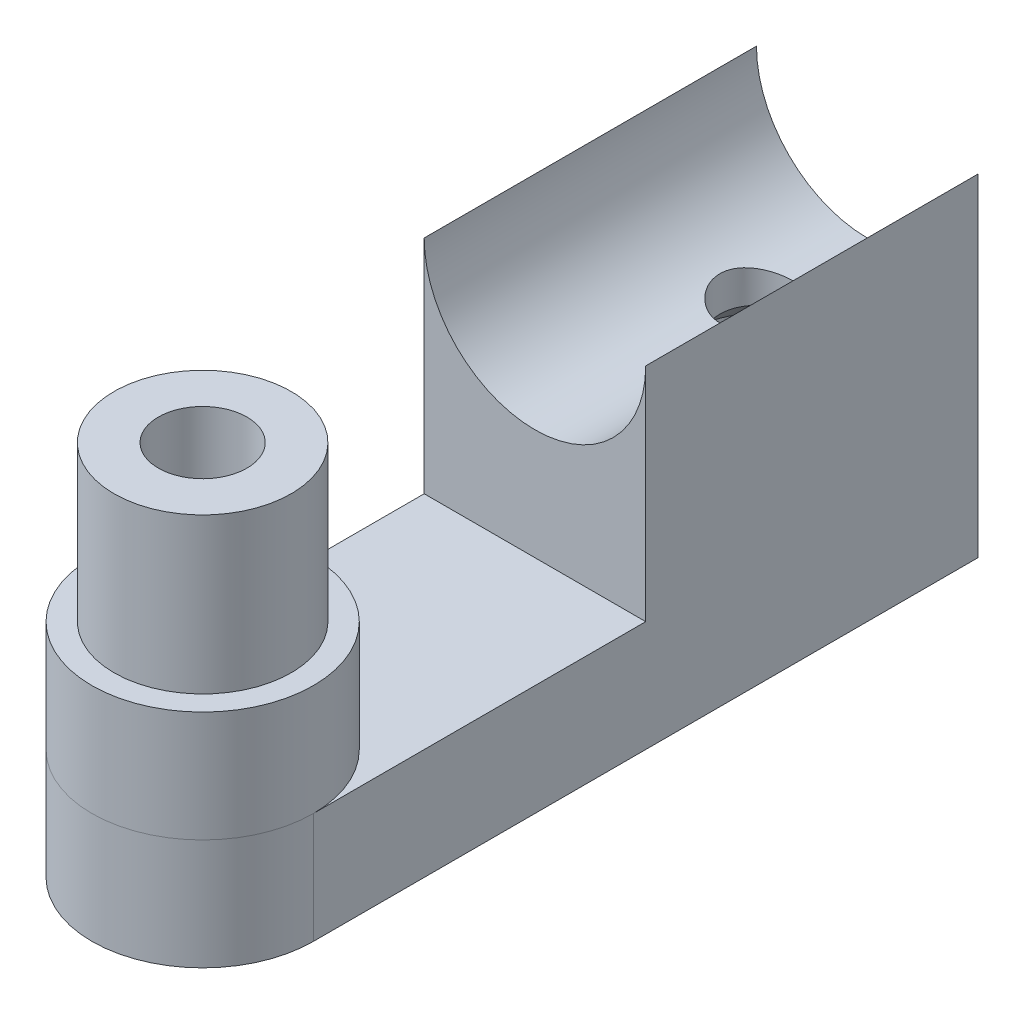
ISO-10303-21;
HEADER;
FILE_DESCRIPTION(('STEP AP214'),'2;1');
FILE_NAME('part.step','',(''),(''),'','','');
FILE_SCHEMA(('AUTOMOTIVE_DESIGN { 1 0 10303 214 1 1 1 1 }'));
ENDSEC;
DATA;
#1=APPLICATION_CONTEXT('core data for automotive mechanical design processes');
#2=APPLICATION_PROTOCOL_DEFINITION('international standard','automotive_design',2000,#1);
#3=PRODUCT_CONTEXT('',#1,'mechanical');
#4=PRODUCT('Part','Part','',(#3));
#5=PRODUCT_RELATED_PRODUCT_CATEGORY('part','',(#4));
#6=PRODUCT_DEFINITION_FORMATION('','',#4);
#7=PRODUCT_DEFINITION_CONTEXT('part definition',#1,'design');
#8=PRODUCT_DEFINITION('design','',#6,#7);
#9=PRODUCT_DEFINITION_SHAPE('','',#8);
#10=(LENGTH_UNIT() NAMED_UNIT(*) SI_UNIT(.MILLI.,.METRE.));
#11=(NAMED_UNIT(*) PLANE_ANGLE_UNIT() SI_UNIT($,.RADIAN.));
#12=(NAMED_UNIT(*) SI_UNIT($,.STERADIAN.) SOLID_ANGLE_UNIT());
#13=UNCERTAINTY_MEASURE_WITH_UNIT(LENGTH_MEASURE(1.E-05),#10,'distance_accuracy_value','');
#14=(GEOMETRIC_REPRESENTATION_CONTEXT(3) GLOBAL_UNCERTAINTY_ASSIGNED_CONTEXT((#13)) GLOBAL_UNIT_ASSIGNED_CONTEXT((#10,
#11,#12)) REPRESENTATION_CONTEXT('',''));
#15=CARTESIAN_POINT('',(0.,0.,0.));
#16=DIRECTION('',(0.,0.,1.));
#17=DIRECTION('',(1.,0.,0.));
#18=AXIS2_PLACEMENT_3D('',#15,#16,#17);
#19=CARTESIAN_POINT('',(0.,-5.,0.));
#20=DIRECTION('',(0.,-1.,0.));
#21=DIRECTION('',(0.,0.,-1.));
#22=AXIS2_PLACEMENT_3D('',#19,#20,#21);
#23=PLANE('',#22);
#24=DIRECTION('',(1.,0.,0.));
#25=VECTOR('',#24,1.);
#26=CARTESIAN_POINT('',(5.,-5.,-15.));
#27=LINE('',#26,#25);
#28=CARTESIAN_POINT('',(-5.,-5.,-15.));
#29=VERTEX_POINT('',#28);
#30=CARTESIAN_POINT('',(5.,-5.,-15.));
#31=VERTEX_POINT('',#30);
#32=EDGE_CURVE('E76',#29,#31,#27,.T.);
#33=ORIENTED_EDGE('',*,*,#32,.F.);
#34=DIRECTION('',(0.,0.,-1.));
#35=VECTOR('',#34,1.);
#36=CARTESIAN_POINT('',(-5.,-5.,0.));
#37=LINE('',#36,#35);
#38=CARTESIAN_POINT('',(-5.,-5.,0.));
#39=VERTEX_POINT('',#38);
#40=EDGE_CURVE('E175',#39,#29,#37,.T.);
#41=ORIENTED_EDGE('',*,*,#40,.F.);
#42=CARTESIAN_POINT('',(0.,-5.,0.));
#43=DIRECTION('',(0.,-1.,0.));
#44=DIRECTION('',(0.,0.,-1.));
#45=AXIS2_PLACEMENT_3D('',#42,#43,#44);
#46=CIRCLE('',#45,5.);
#47=CARTESIAN_POINT('',(5.,-5.,0.));
#48=VERTEX_POINT('',#47);
#49=EDGE_CURVE('E161',#48,#39,#46,.T.);
#50=ORIENTED_EDGE('',*,*,#49,.F.);
#51=DIRECTION('',(0.,0.,1.));
#52=VECTOR('',#51,1.);
#53=CARTESIAN_POINT('',(5.,-5.,-30.));
#54=LINE('',#53,#52);
#55=EDGE_CURVE('E98',#31,#48,#54,.T.);
#56=ORIENTED_EDGE('',*,*,#55,.F.);
#57=EDGE_LOOP('',(#33,#41,#50,#56));
#58=FACE_BOUND('',#57,.T.);
#59=ADVANCED_FACE('F59',(#58),#23,.F.);
#60=CARTESIAN_POINT('',(0.,-10.,0.));
#61=DIRECTION('',(0.,1.,0.));
#62=DIRECTION('',(0.,0.,1.));
#63=AXIS2_PLACEMENT_3D('',#60,#61,#62);
#64=CYLINDRICAL_SURFACE('',#63,5.);
#65=ORIENTED_EDGE('',*,*,#49,.T.);
#66=DIRECTION('',(0.,1.,0.));
#67=VECTOR('',#66,1.);
#68=CARTESIAN_POINT('',(-5.,-10.,0.));
#69=LINE('',#68,#67);
#70=CARTESIAN_POINT('',(-5.,-10.,0.));
#71=VERTEX_POINT('',#70);
#72=EDGE_CURVE('E142',#71,#39,#69,.T.);
#73=ORIENTED_EDGE('',*,*,#72,.F.);
#74=CARTESIAN_POINT('',(0.,-10.,0.));
#75=DIRECTION('',(0.,-1.,0.));
#76=DIRECTION('',(0.,0.,-1.));
#77=AXIS2_PLACEMENT_3D('',#74,#75,#76);
#78=CIRCLE('',#77,5.);
#79=CARTESIAN_POINT('',(5.,-10.,0.));
#80=VERTEX_POINT('',#79);
#81=EDGE_CURVE('E162',#80,#71,#78,.T.);
#82=ORIENTED_EDGE('',*,*,#81,.F.);
#83=DIRECTION('',(0.,1.,0.));
#84=VECTOR('',#83,1.);
#85=CARTESIAN_POINT('',(5.,-10.,0.));
#86=LINE('',#85,#84);
#87=EDGE_CURVE('E171',#80,#48,#86,.T.);
#88=ORIENTED_EDGE('',*,*,#87,.T.);
#89=EDGE_LOOP('',(#65,#73,#82,#88));
#90=FACE_BOUND('',#89,.T.);
#91=ADVANCED_FACE('F211',(#90),#64,.T.);
#92=CARTESIAN_POINT('',(-5.,-10.,0.));
#93=DIRECTION('',(1.,0.,0.));
#94=DIRECTION('',(0.,0.,-1.));
#95=AXIS2_PLACEMENT_3D('',#92,#93,#94);
#96=PLANE('',#95);
#97=ORIENTED_EDGE('',*,*,#40,.T.);
#98=DIRECTION('',(0.,-1.,0.));
#99=VECTOR('',#98,1.);
#100=CARTESIAN_POINT('',(-5.,5.,-15.));
#101=LINE('',#100,#99);
#102=CARTESIAN_POINT('',(-5.,5.,-15.));
#103=VERTEX_POINT('',#102);
#104=EDGE_CURVE('E148',#103,#29,#101,.T.);
#105=ORIENTED_EDGE('',*,*,#104,.F.);
#106=DIRECTION('',(0.,0.,1.));
#107=VECTOR('',#106,1.);
#108=CARTESIAN_POINT('',(-5.,5.,-30.));
#109=LINE('',#108,#107);
#110=CARTESIAN_POINT('',(-5.,5.,-30.));
#111=VERTEX_POINT('',#110);
#112=EDGE_CURVE('E126',#111,#103,#109,.T.);
#113=ORIENTED_EDGE('',*,*,#112,.F.);
#114=DIRECTION('',(0.,1.,0.));
#115=VECTOR('',#114,1.);
#116=CARTESIAN_POINT('',(-5.,-10.,-30.));
#117=LINE('',#116,#115);
#118=CARTESIAN_POINT('',(-5.,-10.,-30.));
#119=VERTEX_POINT('',#118);
#120=EDGE_CURVE('E138',#119,#111,#117,.T.);
#121=ORIENTED_EDGE('',*,*,#120,.F.);
#122=DIRECTION('',(0.,0.,-1.));
#123=VECTOR('',#122,1.);
#124=CARTESIAN_POINT('',(-5.,-10.,0.));
#125=LINE('',#124,#123);
#126=EDGE_CURVE('E106',#71,#119,#125,.T.);
#127=ORIENTED_EDGE('',*,*,#126,.F.);
#128=ORIENTED_EDGE('',*,*,#72,.T.);
#129=EDGE_LOOP('',(#97,#105,#113,#121,#127,#128));
#130=FACE_BOUND('',#129,.T.);
#131=ADVANCED_FACE('F146',(#130),#96,.F.);
#132=CARTESIAN_POINT('',(-5.,-10.,-30.));
#133=DIRECTION('',(0.,0.,1.));
#134=DIRECTION('',(1.,0.,0.));
#135=AXIS2_PLACEMENT_3D('',#132,#133,#134);
#136=PLANE('',#135);
#137=ORIENTED_EDGE('',*,*,#120,.T.);
#138=CARTESIAN_POINT('',(0.,5.,-30.));
#139=DIRECTION('',(0.,0.,-1.));
#140=DIRECTION('',(-1.,0.,0.));
#141=AXIS2_PLACEMENT_3D('',#138,#139,#140);
#142=CIRCLE('',#141,5.);
#143=CARTESIAN_POINT('',(5.,5.,-30.));
#144=VERTEX_POINT('',#143);
#145=EDGE_CURVE('E122',#144,#111,#142,.T.);
#146=ORIENTED_EDGE('',*,*,#145,.F.);
#147=DIRECTION('',(0.,1.,0.));
#148=VECTOR('',#147,1.);
#149=CARTESIAN_POINT('',(5.,-10.,-30.));
#150=LINE('',#149,#148);
#151=CARTESIAN_POINT('',(5.,-10.,-30.));
#152=VERTEX_POINT('',#151);
#153=EDGE_CURVE('E143',#152,#144,#150,.T.);
#154=ORIENTED_EDGE('',*,*,#153,.F.);
#155=DIRECTION('',(1.,0.,0.));
#156=VECTOR('',#155,1.);
#157=CARTESIAN_POINT('',(-5.,-10.,-30.));
#158=LINE('',#157,#156);
#159=EDGE_CURVE('E140',#119,#152,#158,.T.);
#160=ORIENTED_EDGE('',*,*,#159,.F.);
#161=EDGE_LOOP('',(#137,#146,#154,#160));
#162=FACE_BOUND('',#161,.T.);
#163=ADVANCED_FACE('F139',(#162),#136,.F.);
#164=CARTESIAN_POINT('',(5.,-10.,-30.));
#165=DIRECTION('',(-1.,0.,0.));
#166=DIRECTION('',(0.,0.,1.));
#167=AXIS2_PLACEMENT_3D('',#164,#165,#166);
#168=PLANE('',#167);
#169=ORIENTED_EDGE('',*,*,#153,.T.);
#170=DIRECTION('',(0.,0.,-1.));
#171=VECTOR('',#170,1.);
#172=CARTESIAN_POINT('',(5.,5.,-30.));
#173=LINE('',#172,#171);
#174=CARTESIAN_POINT('',(5.,5.,-15.));
#175=VERTEX_POINT('',#174);
#176=EDGE_CURVE('E129',#175,#144,#173,.T.);
#177=ORIENTED_EDGE('',*,*,#176,.F.);
#178=DIRECTION('',(0.,-1.,0.));
#179=VECTOR('',#178,1.);
#180=CARTESIAN_POINT('',(5.,5.,-15.));
#181=LINE('',#180,#179);
#182=EDGE_CURVE('E150',#175,#31,#181,.T.);
#183=ORIENTED_EDGE('',*,*,#182,.T.);
#184=ORIENTED_EDGE('',*,*,#55,.T.);
#185=ORIENTED_EDGE('',*,*,#87,.F.);
#186=DIRECTION('',(0.,0.,1.));
#187=VECTOR('',#186,1.);
#188=CARTESIAN_POINT('',(5.,-10.,-30.));
#189=LINE('',#188,#187);
#190=EDGE_CURVE('E85',#152,#80,#189,.T.);
#191=ORIENTED_EDGE('',*,*,#190,.F.);
#192=EDGE_LOOP('',(#169,#177,#183,#184,#185,#191));
#193=FACE_BOUND('',#192,.T.);
#194=ADVANCED_FACE('F220',(#193),#168,.F.);
#195=CARTESIAN_POINT('',(0.,-10.,0.));
#196=DIRECTION('',(0.,-1.,0.));
#197=DIRECTION('',(0.,0.,-1.));
#198=AXIS2_PLACEMENT_3D('',#195,#196,#197);
#199=PLANE('',#198);
#200=CARTESIAN_POINT('',(0.,-10.,-25.));
#201=DIRECTION('',(0.,-1.,0.));
#202=DIRECTION('',(0.,0.,-1.));
#203=AXIS2_PLACEMENT_3D('',#200,#201,#202);
#204=CIRCLE('',#203,2.75);
#205=CARTESIAN_POINT('',(0.,-10.,-27.75));
#206=VERTEX_POINT('',#205);
#207=EDGE_CURVE('E135',#206,#206,#204,.T.);
#208=ORIENTED_EDGE('',*,*,#207,.F.);
#209=EDGE_LOOP('',(#208));
#210=FACE_BOUND('',#209,.T.);
#211=ORIENTED_EDGE('',*,*,#81,.T.);
#212=ORIENTED_EDGE('',*,*,#126,.T.);
#213=ORIENTED_EDGE('',*,*,#159,.T.);
#214=ORIENTED_EDGE('',*,*,#190,.T.);
#215=EDGE_LOOP('',(#211,#212,#213,#214));
#216=FACE_BOUND('',#215,.T.);
#217=ADVANCED_FACE('F219',(#210,#216),#199,.T.);
#218=CARTESIAN_POINT('',(5.,5.,-15.));
#219=DIRECTION('',(0.,0.,-1.));
#220=DIRECTION('',(-1.,0.,0.));
#221=AXIS2_PLACEMENT_3D('',#218,#219,#220);
#222=PLANE('',#221);
#223=ORIENTED_EDGE('',*,*,#182,.F.);
#224=CARTESIAN_POINT('',(0.,5.,-15.));
#225=DIRECTION('',(0.,0.,-1.));
#226=DIRECTION('',(-1.,0.,0.));
#227=AXIS2_PLACEMENT_3D('',#224,#225,#226);
#228=CIRCLE('',#227,5.);
#229=EDGE_CURVE('E134',#103,#175,#228,.F.);
#230=ORIENTED_EDGE('',*,*,#229,.F.);
#231=ORIENTED_EDGE('',*,*,#104,.T.);
#232=ORIENTED_EDGE('',*,*,#32,.T.);
#233=EDGE_LOOP('',(#223,#230,#231,#232));
#234=FACE_BOUND('',#233,.T.);
#235=ADVANCED_FACE('F207',(#234),#222,.F.);
#236=CARTESIAN_POINT('',(0.,5.,-3.81966011250105));
#237=DIRECTION('',(0.,0.,-1.));
#238=DIRECTION('',(-1.,0.,0.));
#239=AXIS2_PLACEMENT_3D('',#236,#237,#238);
#240=CYLINDRICAL_SURFACE('',#239,5.);
#241=CARTESIAN_POINT('',(0.,0.,-26.65));
#242=CARTESIAN_POINT('',(0.0900803323989871,-1.25648819785886E-07,-26.6500002425144));
#243=CARTESIAN_POINT('',(0.180159574077354,0.00245687382126915,-26.642599162515));
#244=CARTESIAN_POINT('',(0.357667875169258,0.0120165182884763,-26.6132788504724));
#245=CARTESIAN_POINT('',(0.445096605656321,0.0191197374286571,-26.5913578241647));
#246=CARTESIAN_POINT('',(0.614719075952393,0.0371993185679961,-26.5338286876117));
#247=CARTESIAN_POINT('',(0.696921201899965,0.0481692812331644,-26.498243182986));
#248=CARTESIAN_POINT('',(0.854190645874482,0.0728605275116146,-26.4144964273082));
#249=CARTESIAN_POINT('',(0.929256597076053,0.0865823366403418,-26.3663327736966));
#250=CARTESIAN_POINT('',(1.07267700256014,0.115853320239857,-26.2570751769286));
#251=CARTESIAN_POINT('',(1.140755021368,0.131445631134127,-26.1956299817258));
#252=CARTESIAN_POINT('',(1.26585047260417,0.16246092195993,-26.0623004860802));
#253=CARTESIAN_POINT('',(1.32286553369749,0.177883864920705,-25.9904139533073));
#254=CARTESIAN_POINT('',(1.42578155512387,0.207286868266667,-25.8357693876205));
#255=CARTESIAN_POINT('',(1.47132547146369,0.221214251011649,-25.7527627624148));
#256=CARTESIAN_POINT('',(1.54768950007051,0.245394505162284,-25.5797343691659));
#257=CARTESIAN_POINT('',(1.57851400356116,0.255648472225038,-25.4897147026477));
#258=CARTESIAN_POINT('',(1.62353134991424,0.270867173648994,-25.3083551709187));
#259=CARTESIAN_POINT('',(1.6382413417332,0.275995877642336,-25.2171578366744));
#260=CARTESIAN_POINT('',(1.65222861163856,0.280868653520504,-25.033456387306));
#261=CARTESIAN_POINT('',(1.65151054662635,0.280614350246335,-24.9409526749323));
#262=CARTESIAN_POINT('',(1.63506410098719,0.274893708924319,-24.7616527976077));
#263=CARTESIAN_POINT('',(1.62000769651632,0.269660711203189,-24.6747862647612));
#264=CARTESIAN_POINT('',(1.57640708934977,0.254953674765128,-24.5048890938333));
#265=CARTESIAN_POINT('',(1.54786130181506,0.245479137725619,-24.4218589077347));
#266=CARTESIAN_POINT('',(1.47764674240873,0.223188260590001,-24.2604525600054));
#267=CARTESIAN_POINT('',(1.43577693123636,0.210321280523172,-24.1821711497747));
#268=CARTESIAN_POINT('',(1.34024242388315,0.182716840839682,-24.0335316376985));
#269=CARTESIAN_POINT('',(1.28657437554159,0.1679788501281,-23.9631757963059));
#270=CARTESIAN_POINT('',(1.16572801734404,0.137372017574341,-23.8286047725898));
#271=CARTESIAN_POINT('',(1.09799945388895,0.121483874059835,-23.7648871213569));
#272=CARTESIAN_POINT('',(0.952622363558089,0.0910266541347035,-23.6495858217608));
#273=CARTESIAN_POINT('',(0.874972923819721,0.0764576993193701,-23.598003291245));
#274=CARTESIAN_POINT('',(0.710918878360195,0.0500957074006091,-23.508046483163));
#275=CARTESIAN_POINT('',(0.624437715003007,0.038330520638852,-23.4698031027869));
#276=CARTESIAN_POINT('',(0.445788820584336,0.0191036548526561,-23.4085602803937));
#277=CARTESIAN_POINT('',(0.353623035566634,0.0116405120416556,-23.3855556529359));
#278=CARTESIAN_POINT('',(0.170434936942809,0.00209998070460758,-23.3563192146167));
#279=CARTESIAN_POINT('',(0.0795310449403306,-0.00019320840938875,-23.3494149063605));
#280=CARTESIAN_POINT('',(-0.102152997074191,0.000218796006793008,-23.3506626326913));
#281=CARTESIAN_POINT('',(-0.19293316503069,0.00292316476573073,-23.3588121828668));
#282=CARTESIAN_POINT('',(-0.369117276094976,0.0128840710918336,-23.3894028261829));
#283=CARTESIAN_POINT('',(-0.454600657078433,0.0200097019350463,-23.4114332100145));
#284=CARTESIAN_POINT('',(-0.620625393385987,0.0379638978335999,-23.4686486915117));
#285=CARTESIAN_POINT('',(-0.701166119538832,0.0487929331624024,-23.5038354598819));
#286=CARTESIAN_POINT('',(-0.857353583850656,0.0734026180974383,-23.5873810195524));
#287=CARTESIAN_POINT('',(-0.932818538636808,0.0872527140051663,-23.6360586147645));
#288=CARTESIAN_POINT('',(-1.07472879779133,0.116331936609704,-23.7448282347959));
#289=CARTESIAN_POINT('',(-1.14117138619964,0.131561476264165,-23.804923683674));
#290=CARTESIAN_POINT('',(-1.26622547851877,0.162540901525089,-23.9379861726919));
#291=CARTESIAN_POINT('',(-1.32435715949936,0.17828379839998,-24.0114068669237));
#292=CARTESIAN_POINT('',(-1.42753142742357,0.207814329533679,-24.1672998548937));
#293=CARTESIAN_POINT('',(-1.47257396443646,0.22160195633368,-24.2497721831592));
#294=CARTESIAN_POINT('',(-1.54806908435208,0.245522531296669,-24.4214254839583));
#295=CARTESIAN_POINT('',(-1.57855621066785,0.255664118086352,-24.5105899859772));
#296=CARTESIAN_POINT('',(-1.62395003915296,0.271007337532005,-24.6931979020796));
#297=CARTESIAN_POINT('',(-1.6388635764124,0.276211137240915,-24.786639420212));
#298=CARTESIAN_POINT('',(-1.65216049477084,0.28084647255143,-24.9700854249129));
#299=CARTESIAN_POINT('',(-1.65133872365081,0.280555575821336,-25.0600259363782));
#300=CARTESIAN_POINT('',(-1.63513842564514,0.274918605094376,-25.2384165995901));
#301=CARTESIAN_POINT('',(-1.61976073262756,0.269572820677908,-25.3268668364151));
#302=CARTESIAN_POINT('',(-1.57544291875232,0.254633062355389,-25.4981641371846));
#303=CARTESIAN_POINT('',(-1.5467552709297,0.245118347106362,-25.5810839721575));
#304=CARTESIAN_POINT('',(-1.47683540940046,0.22294064384867,-25.7409974926626));
#305=CARTESIAN_POINT('',(-1.43560044678477,0.210276966065668,-25.8179898749519));
#306=CARTESIAN_POINT('',(-1.33969084183066,0.182550606512366,-25.9674434543664));
#307=CARTESIAN_POINT('',(-1.28451538865982,0.167408295565111,-26.0395684110698));
#308=CARTESIAN_POINT('',(-1.16314331347536,0.136769569369362,-26.173792580675));
#309=CARTESIAN_POINT('',(-1.09694360376003,0.121273055966985,-26.2358889751267));
#310=CARTESIAN_POINT('',(-0.95238767673411,0.090966824512267,-26.3506633318093));
#311=CARTESIAN_POINT('',(-0.873665758138173,0.076205410886734,-26.4028950216852));
#312=CARTESIAN_POINT('',(-0.70807708205127,0.0496824975120341,-26.4933248578978));
#313=CARTESIAN_POINT('',(-0.621212604024481,0.0379201615975139,-26.5315269171114));
#314=CARTESIAN_POINT('',(-0.446386541872214,0.0192304696753828,-26.5910130150305));
#315=CARTESIAN_POINT('',(-0.358709155083953,0.0120862823678573,-26.613063522484));
#316=CARTESIAN_POINT('',(-0.180687007883429,0.00247172519183232,-26.6425549720432));
#317=CARTESIAN_POINT('',(-0.0903429553968482,1.26015141993446E-07,-26.6499997567786));
#318=CARTESIAN_POINT('',(0.,0.,-26.65));
#319=B_SPLINE_CURVE_WITH_KNOTS('',3,(#241,#242,#243,#244,#245,#246,#247,#248,#249,#250,#251,
#252,#253,#254,#255,#256,#257,#258,#259,#260,#261,#262,#263,#264,#265,#266,#267,#268,#269,#270,
#271,#272,#273,#274,#275,#276,#277,#278,#279,#280,#281,#282,#283,#284,#285,#286,#287,#288,#289,
#290,#291,#292,#293,#294,#295,#296,#297,#298,#299,#300,#301,#302,#303,#304,#305,#306,#307,#308,
#309,#310,#311,#312,#313,#314,#315,#316,#317,#318),.UNSPECIFIED.,.T.,.F.,(4,2,2,2,2,2,2,2,2,2,2,
2,2,2,2,2,2,2,2,2,2,2,2,2,2,2,2,2,2,2,2,2,2,2,2,2,2,2,4),(0.,0.2699086041325,0.539850567737247,
0.809347867689093,1.07889668217443,1.35671215765951,1.63458711701568,1.92026489148117,
2.20585738673402,2.48198869358466,2.75803665240173,3.02175295330504,3.28550024538372,
3.55343249441286,3.82144096800204,4.10314526837295,4.38487550826387,4.66929734218009,
4.95362234329175,5.22584041060146,5.49801355645392,5.76248915124947,6.02699834271655,
6.29838751507405,6.56985820217368,6.85340472718154,7.13695233381086,7.41982362841787,
7.70257072144072,7.97107468624609,8.23956327014096,8.50315503612411,8.76680459233092,
9.04176838412562,9.31680931840238,9.60227659952698,9.88766420298745,10.1584309528124,
10.4291264568694),.UNSPECIFIED.);
#320=CARTESIAN_POINT('',(0.,0.,-26.65));
#321=VERTEX_POINT('',#320);
#322=EDGE_CURVE('E186',#321,#321,#319,.T.);
#323=ORIENTED_EDGE('',*,*,#322,.T.);
#324=EDGE_LOOP('',(#323));
#325=FACE_BOUND('',#324,.T.);
#326=ORIENTED_EDGE('',*,*,#229,.T.);
#327=ORIENTED_EDGE('',*,*,#176,.T.);
#328=ORIENTED_EDGE('',*,*,#145,.T.);
#329=ORIENTED_EDGE('',*,*,#112,.T.);
#330=EDGE_LOOP('',(#326,#327,#328,#329));
#331=FACE_BOUND('',#330,.T.);
#332=ADVANCED_FACE('F124',(#325,#331),#240,.F.);
#333=CARTESIAN_POINT('',(0.,-2.5,-25.));
#334=DIRECTION('',(0.,-1.,0.));
#335=DIRECTION('',(0.,0.,-1.));
#336=AXIS2_PLACEMENT_3D('',#333,#334,#335);
#337=CYLINDRICAL_SURFACE('',#336,2.75);
#338=CARTESIAN_POINT('',(0.,-2.39999999999999,-25.));
#339=DIRECTION('',(0.,-1.,0.));
#340=DIRECTION('',(0.,0.,-1.));
#341=AXIS2_PLACEMENT_3D('',#338,#339,#340);
#342=CIRCLE('',#341,2.75);
#343=CARTESIAN_POINT('',(0.,-2.39999999999999,-27.75));
#344=VERTEX_POINT('',#343);
#345=EDGE_CURVE('E12',#344,#344,#342,.F.);
#346=ORIENTED_EDGE('',*,*,#345,.T.);
#347=EDGE_LOOP('',(#346));
#348=FACE_BOUND('',#347,.T.);
#349=ORIENTED_EDGE('',*,*,#207,.T.);
#350=EDGE_LOOP('',(#349));
#351=FACE_BOUND('',#350,.T.);
#352=ADVANCED_FACE('F200',(#348,#351),#337,.F.);
#353=CARTESIAN_POINT('',(0.,7.,-25.));
#354=DIRECTION('',(0.,-1.,0.));
#355=DIRECTION('',(0.,0.,-1.));
#356=AXIS2_PLACEMENT_3D('',#353,#354,#355);
#357=CYLINDRICAL_SURFACE('',#356,1.65);
#358=CARTESIAN_POINT('',(0.,-1.29999999999998,-25.));
#359=DIRECTION('',(0.,-1.,0.));
#360=DIRECTION('',(0.,0.,-1.));
#361=AXIS2_PLACEMENT_3D('',#358,#359,#360);
#362=CIRCLE('',#361,1.65);
#363=CARTESIAN_POINT('',(0.,-1.29999999999998,-26.65));
#364=VERTEX_POINT('',#363);
#365=EDGE_CURVE('E69',#364,#364,#362,.T.);
#366=ORIENTED_EDGE('',*,*,#365,.T.);
#367=EDGE_LOOP('',(#366));
#368=FACE_BOUND('',#367,.T.);
#369=ORIENTED_EDGE('',*,*,#322,.F.);
#370=EDGE_LOOP('',(#369));
#371=FACE_BOUND('',#370,.T.);
#372=ADVANCED_FACE('F197',(#368,#371),#357,.F.);
#373=CARTESIAN_POINT('',(0.,-1.29999999999998,-25.));
#374=DIRECTION('',(0.,-1.,0.));
#375=DIRECTION('',(0.,0.,-1.));
#376=AXIS2_PLACEMENT_3D('',#373,#374,#375);
#377=CONICAL_SURFACE('',#376,1.65,0.785398163397444);
#378=CARTESIAN_POINT('',(0.,-2.39999999999999,-27.75));
#379=CARTESIAN_POINT('',(0.,-2.38854166666666,-27.7385416666667));
#380=CARTESIAN_POINT('',(0.,-2.37708333333332,-27.7270833333333));
#381=CARTESIAN_POINT('',(0.,-2.35416666666666,-27.7041666666667));
#382=CARTESIAN_POINT('',(0.,-2.34270833333332,-27.6927083333333));
#383=CARTESIAN_POINT('',(0.,-2.31979166666666,-27.6697916666667));
#384=CARTESIAN_POINT('',(0.,-2.30833333333332,-27.6583333333333));
#385=CARTESIAN_POINT('',(0.,-2.28541666666665,-27.6354166666667));
#386=CARTESIAN_POINT('',(0.,-2.27395833333332,-27.6239583333333));
#387=CARTESIAN_POINT('',(0.,-2.25104166666665,-27.6010416666667));
#388=CARTESIAN_POINT('',(0.,-2.23958333333332,-27.5895833333333));
#389=CARTESIAN_POINT('',(0.,-2.21666666666665,-27.5666666666667));
#390=CARTESIAN_POINT('',(0.,-2.20520833333332,-27.5552083333333));
#391=CARTESIAN_POINT('',(0.,-2.18229166666665,-27.5322916666667));
#392=CARTESIAN_POINT('',(0.,-2.17083333333332,-27.5208333333333));
#393=CARTESIAN_POINT('',(0.,-2.14791666666665,-27.4979166666667));
#394=CARTESIAN_POINT('',(0.,-2.13645833333332,-27.4864583333333));
#395=CARTESIAN_POINT('',(0.,-2.11354166666665,-27.4635416666667));
#396=CARTESIAN_POINT('',(0.,-2.10208333333332,-27.4520833333333));
#397=CARTESIAN_POINT('',(0.,-2.07916666666665,-27.4291666666667));
#398=CARTESIAN_POINT('',(0.,-2.06770833333332,-27.4177083333333));
#399=CARTESIAN_POINT('',(0.,-2.04479166666665,-27.3947916666667));
#400=CARTESIAN_POINT('',(0.,-2.03333333333332,-27.3833333333333));
#401=CARTESIAN_POINT('',(0.,-2.01041666666665,-27.3604166666667));
#402=CARTESIAN_POINT('',(0.,-1.99895833333332,-27.3489583333333));
#403=CARTESIAN_POINT('',(0.,-1.97604166666665,-27.3260416666667));
#404=CARTESIAN_POINT('',(0.,-1.96458333333332,-27.3145833333333));
#405=CARTESIAN_POINT('',(0.,-1.94166666666665,-27.2916666666667));
#406=CARTESIAN_POINT('',(0.,-1.93020833333332,-27.2802083333333));
#407=CARTESIAN_POINT('',(0.,-1.90729166666665,-27.2572916666667));
#408=CARTESIAN_POINT('',(0.,-1.89583333333332,-27.2458333333333));
#409=CARTESIAN_POINT('',(0.,-1.87291666666665,-27.2229166666667));
#410=CARTESIAN_POINT('',(0.,-1.86145833333332,-27.2114583333333));
#411=CARTESIAN_POINT('',(0.,-1.83854166666665,-27.1885416666667));
#412=CARTESIAN_POINT('',(0.,-1.82708333333332,-27.1770833333333));
#413=CARTESIAN_POINT('',(0.,-1.80416666666665,-27.1541666666667));
#414=CARTESIAN_POINT('',(0.,-1.79270833333332,-27.1427083333333));
#415=CARTESIAN_POINT('',(0.,-1.76979166666665,-27.1197916666667));
#416=CARTESIAN_POINT('',(0.,-1.75833333333332,-27.1083333333333));
#417=CARTESIAN_POINT('',(0.,-1.73541666666665,-27.0854166666667));
#418=CARTESIAN_POINT('',(0.,-1.72395833333332,-27.0739583333333));
#419=CARTESIAN_POINT('',(0.,-1.70104166666665,-27.0510416666667));
#420=CARTESIAN_POINT('',(0.,-1.68958333333332,-27.0395833333333));
#421=CARTESIAN_POINT('',(0.,-1.66666666666665,-27.0166666666667));
#422=CARTESIAN_POINT('',(0.,-1.65520833333332,-27.0052083333333));
#423=CARTESIAN_POINT('',(0.,-1.63229166666665,-26.9822916666667));
#424=CARTESIAN_POINT('',(0.,-1.62083333333332,-26.9708333333333));
#425=CARTESIAN_POINT('',(0.,-1.59791666666665,-26.9479166666667));
#426=CARTESIAN_POINT('',(0.,-1.58645833333332,-26.9364583333333));
#427=CARTESIAN_POINT('',(0.,-1.56354166666665,-26.9135416666667));
#428=CARTESIAN_POINT('',(0.,-1.55208333333332,-26.9020833333333));
#429=CARTESIAN_POINT('',(0.,-1.52916666666665,-26.8791666666667));
#430=CARTESIAN_POINT('',(0.,-1.51770833333332,-26.8677083333333));
#431=CARTESIAN_POINT('',(0.,-1.49479166666665,-26.8447916666667));
#432=CARTESIAN_POINT('',(0.,-1.48333333333331,-26.8333333333333));
#433=CARTESIAN_POINT('',(0.,-1.46041666666665,-26.8104166666667));
#434=CARTESIAN_POINT('',(0.,-1.44895833333331,-26.7989583333333));
#435=CARTESIAN_POINT('',(0.,-1.42604166666665,-26.7760416666667));
#436=CARTESIAN_POINT('',(0.,-1.41458333333331,-26.7645833333333));
#437=CARTESIAN_POINT('',(0.,-1.39166666666665,-26.7416666666667));
#438=CARTESIAN_POINT('',(0.,-1.38020833333331,-26.7302083333333));
#439=CARTESIAN_POINT('',(0.,-1.35729166666665,-26.7072916666667));
#440=CARTESIAN_POINT('',(0.,-1.34583333333331,-26.6958333333333));
#441=CARTESIAN_POINT('',(0.,-1.32291666666665,-26.6729166666667));
#442=CARTESIAN_POINT('',(0.,-1.31145833333331,-26.6614583333333));
#443=CARTESIAN_POINT('',(0.,-1.29999999999998,-26.65));
#444=B_SPLINE_CURVE_WITH_KNOTS('',3,(#378,#379,#380,#381,#382,#383,#384,#385,#386,#387,#388,
#389,#390,#391,#392,#393,#394,#395,#396,#397,#398,#399,#400,#401,#402,#403,#404,#405,#406,#407,
#408,#409,#410,#411,#412,#413,#414,#415,#416,#417,#418,#419,#420,#421,#422,#423,#424,#425,#426,
#427,#428,#429,#430,#431,#432,#433,#434,#435,#436,#437,#438,#439,#440,#441,#442,#443),
.UNSPECIFIED.,.F.,.F.,(4,2,2,2,2,2,2,2,2,2,2,2,2,2,2,2,2,2,2,2,2,2,2,2,2,2,2,2,2,2,2,2,4),(0.,
0.048613591206575,0.09722718241315,0.145840773619725,0.1944543648263,0.243067956032878,
0.291681547239453,0.340295138446028,0.388908729652603,0.437522320859178,0.486135912065753,
0.534749503272329,0.583363094478904,0.631976685685479,0.680590276892054,0.729203868098629,
0.777817459305207,0.826431050511779,0.875044641718357,0.923658232924932,0.972271824131507,
1.02088541533808,1.06949900654466,1.11811259775123,1.16672618895781,1.21533978016438,
1.26395337137096,1.31256696257753,1.36118055378411,1.40979414499069,1.45840773619726,
1.50702132740384,1.55563491861041),.UNSPECIFIED.);
#445=EDGE_CURVE('BSEAM62',#344,#364,#444,.T.);
#446=ORIENTED_EDGE('',*,*,#345,.F.);
#447=ORIENTED_EDGE('',*,*,#365,.F.);
#448=ORIENTED_EDGE('',*,*,#445,.T.);
#449=ORIENTED_EDGE('',*,*,#445,.F.);
#450=EDGE_LOOP('',(#446,#448,#447,#449));
#451=FACE_BOUND('',#450,.T.);
#452=ADVANCED_FACE('F62',(#451),#377,.F.);
#453=CLOSED_SHELL('',(#59,#91,#131,#163,#194,#217,#235,#332,#352,#372,#452));
#454=MANIFOLD_SOLID_BREP('B2',#453);
#455=CARTESIAN_POINT('',(0.,7.,0.));
#456=DIRECTION('',(0.,-1.,0.));
#457=DIRECTION('',(0.,0.,-1.));
#458=AXIS2_PLACEMENT_3D('',#455,#456,#457);
#459=CYLINDRICAL_SURFACE('',#458,4.);
#460=CARTESIAN_POINT('',(0.,7.,0.));
#461=DIRECTION('',(0.,1.,0.));
#462=DIRECTION('',(0.,0.,1.));
#463=AXIS2_PLACEMENT_3D('',#460,#461,#462);
#464=CIRCLE('',#463,4.);
#465=CARTESIAN_POINT('',(0.,7.,4.));
#466=VERTEX_POINT('',#465);
#467=EDGE_CURVE('E58',#466,#466,#464,.T.);
#468=ORIENTED_EDGE('',*,*,#467,.F.);
#469=EDGE_LOOP('',(#468));
#470=FACE_BOUND('',#469,.T.);
#471=CARTESIAN_POINT('',(0.,0.,0.));
#472=DIRECTION('',(0.,1.,0.));
#473=DIRECTION('',(0.,0.,1.));
#474=AXIS2_PLACEMENT_3D('',#471,#472,#473);
#475=CIRCLE('',#474,4.);
#476=CARTESIAN_POINT('',(0.,0.,4.));
#477=VERTEX_POINT('',#476);
#478=EDGE_CURVE('E375',#477,#477,#475,.T.);
#479=ORIENTED_EDGE('',*,*,#478,.T.);
#480=EDGE_LOOP('',(#479));
#481=FACE_BOUND('',#480,.T.);
#482=ADVANCED_FACE('F368',(#470,#481),#459,.T.);
#483=CARTESIAN_POINT('',(0.,7.,0.));
#484=DIRECTION('',(0.,1.,0.));
#485=DIRECTION('',(0.,0.,1.));
#486=AXIS2_PLACEMENT_3D('',#483,#484,#485);
#487=PLANE('',#486);
#488=CARTESIAN_POINT('',(0.,7.,0.));
#489=DIRECTION('',(0.,-1.,0.));
#490=DIRECTION('',(0.,0.,-1.));
#491=AXIS2_PLACEMENT_3D('',#488,#489,#490);
#492=CIRCLE('',#491,2.);
#493=CARTESIAN_POINT('',(0.,7.,-2.));
#494=VERTEX_POINT('',#493);
#495=EDGE_CURVE('E390',#494,#494,#492,.T.);
#496=ORIENTED_EDGE('',*,*,#495,.T.);
#497=EDGE_LOOP('',(#496));
#498=FACE_BOUND('',#497,.T.);
#499=ORIENTED_EDGE('',*,*,#467,.T.);
#500=EDGE_LOOP('',(#499));
#501=FACE_BOUND('',#500,.T.);
#502=ADVANCED_FACE('F416',(#498,#501),#487,.T.);
#503=CARTESIAN_POINT('',(0.,-5.,0.));
#504=DIRECTION('',(0.,1.,0.));
#505=DIRECTION('',(0.,0.,1.));
#506=AXIS2_PLACEMENT_3D('',#503,#504,#505);
#507=CYLINDRICAL_SURFACE('',#506,5.);
#508=CARTESIAN_POINT('',(0.,-5.,0.));
#509=DIRECTION('',(0.,-1.,0.));
#510=DIRECTION('',(0.,0.,-1.));
#511=AXIS2_PLACEMENT_3D('',#508,#509,#510);
#512=CIRCLE('',#511,5.);
#513=CARTESIAN_POINT('',(0.,-5.,-5.));
#514=VERTEX_POINT('',#513);
#515=EDGE_CURVE('E380',#514,#514,#512,.T.);
#516=ORIENTED_EDGE('',*,*,#515,.F.);
#517=EDGE_LOOP('',(#516));
#518=FACE_BOUND('',#517,.T.);
#519=CARTESIAN_POINT('',(0.,0.,0.));
#520=DIRECTION('',(0.,-1.,0.));
#521=DIRECTION('',(0.,0.,-1.));
#522=AXIS2_PLACEMENT_3D('',#519,#520,#521);
#523=CIRCLE('',#522,5.);
#524=CARTESIAN_POINT('',(0.,0.,-5.));
#525=VERTEX_POINT('',#524);
#526=EDGE_CURVE('E382',#525,#525,#523,.T.);
#527=ORIENTED_EDGE('',*,*,#526,.T.);
#528=EDGE_LOOP('',(#527));
#529=FACE_BOUND('',#528,.T.);
#530=ADVANCED_FACE('F421',(#518,#529),#507,.T.);
#531=CARTESIAN_POINT('',(0.,-5.,0.));
#532=DIRECTION('',(0.,-1.,0.));
#533=DIRECTION('',(0.,0.,-1.));
#534=AXIS2_PLACEMENT_3D('',#531,#532,#533);
#535=PLANE('',#534);
#536=CARTESIAN_POINT('',(0.,-5.,0.));
#537=DIRECTION('',(0.,-1.,0.));
#538=DIRECTION('',(0.,0.,-1.));
#539=AXIS2_PLACEMENT_3D('',#536,#537,#538);
#540=CIRCLE('',#539,1.65);
#541=CARTESIAN_POINT('',(0.,-5.,-1.65));
#542=VERTEX_POINT('',#541);
#543=EDGE_CURVE('E385',#542,#542,#540,.F.);
#544=ORIENTED_EDGE('',*,*,#543,.T.);
#545=EDGE_LOOP('',(#544));
#546=FACE_BOUND('',#545,.T.);
#547=ORIENTED_EDGE('',*,*,#515,.T.);
#548=EDGE_LOOP('',(#547));
#549=FACE_BOUND('',#548,.T.);
#550=ADVANCED_FACE('F428',(#546,#549),#535,.T.);
#551=CARTESIAN_POINT('',(0.,0.,0.));
#552=DIRECTION('',(0.,-1.,0.));
#553=DIRECTION('',(0.,0.,-1.));
#554=AXIS2_PLACEMENT_3D('',#551,#552,#553);
#555=PLANE('',#554);
#556=ORIENTED_EDGE('',*,*,#478,.F.);
#557=EDGE_LOOP('',(#556));
#558=FACE_BOUND('',#557,.T.);
#559=ORIENTED_EDGE('',*,*,#526,.F.);
#560=EDGE_LOOP('',(#559));
#561=FACE_BOUND('',#560,.T.);
#562=ADVANCED_FACE('F413',(#558,#561),#555,.F.);
#563=CARTESIAN_POINT('',(0.,-9.66690475583121,0.));
#564=DIRECTION('',(0.,1.,0.));
#565=DIRECTION('',(0.,0.,1.));
#566=AXIS2_PLACEMENT_3D('',#563,#564,#565);
#567=CYLINDRICAL_SURFACE('',#566,1.65);
#568=CARTESIAN_POINT('',(0.,2.,0.));
#569=DIRECTION('',(0.,-1.,0.));
#570=DIRECTION('',(0.,0.,-1.));
#571=AXIS2_PLACEMENT_3D('',#568,#569,#570);
#572=CIRCLE('',#571,1.65);
#573=CARTESIAN_POINT('',(0.,2.,-1.65));
#574=VERTEX_POINT('',#573);
#575=EDGE_CURVE('E371',#574,#574,#572,.F.);
#576=ORIENTED_EDGE('',*,*,#575,.T.);
#577=EDGE_LOOP('',(#576));
#578=FACE_BOUND('',#577,.T.);
#579=ORIENTED_EDGE('',*,*,#543,.F.);
#580=EDGE_LOOP('',(#579));
#581=FACE_BOUND('',#580,.T.);
#582=ADVANCED_FACE('F400',(#578,#581),#567,.F.);
#583=CARTESIAN_POINT('',(0.,2.,0.));
#584=DIRECTION('',(0.,-1.,0.));
#585=DIRECTION('',(0.,0.,-1.));
#586=AXIS2_PLACEMENT_3D('',#583,#584,#585);
#587=PLANE('',#586);
#588=CARTESIAN_POINT('',(0.,2.,0.));
#589=DIRECTION('',(0.,-1.,0.));
#590=DIRECTION('',(0.,0.,-1.));
#591=AXIS2_PLACEMENT_3D('',#588,#589,#590);
#592=CIRCLE('',#591,2.);
#593=CARTESIAN_POINT('',(0.,2.,-2.));
#594=VERTEX_POINT('',#593);
#595=EDGE_CURVE('E393',#594,#594,#592,.T.);
#596=ORIENTED_EDGE('',*,*,#595,.F.);
#597=EDGE_LOOP('',(#596));
#598=FACE_BOUND('',#597,.T.);
#599=ORIENTED_EDGE('',*,*,#575,.F.);
#600=EDGE_LOOP('',(#599));
#601=FACE_BOUND('',#600,.T.);
#602=ADVANCED_FACE('F403',(#598,#601),#587,.F.);
#603=CARTESIAN_POINT('',(0.,2.,0.));
#604=DIRECTION('',(0.,1.,0.));
#605=DIRECTION('',(0.,0.,1.));
#606=AXIS2_PLACEMENT_3D('',#603,#604,#605);
#607=CYLINDRICAL_SURFACE('',#606,2.);
#608=ORIENTED_EDGE('',*,*,#595,.T.);
#609=EDGE_LOOP('',(#608));
#610=FACE_BOUND('',#609,.T.);
#611=ORIENTED_EDGE('',*,*,#495,.F.);
#612=EDGE_LOOP('',(#611));
#613=FACE_BOUND('',#612,.T.);
#614=ADVANCED_FACE('F405',(#610,#613),#607,.F.);
#615=CLOSED_SHELL('',(#482,#502,#530,#550,#562,#582,#602,#614));
#616=MANIFOLD_SOLID_BREP('B6',#615);
#617=ADVANCED_BREP_SHAPE_REPRESENTATION('',(#18,#454,#616),#14);
#618=SHAPE_DEFINITION_REPRESENTATION(#9,#617);
ENDSEC;
END-ISO-10303-21;
